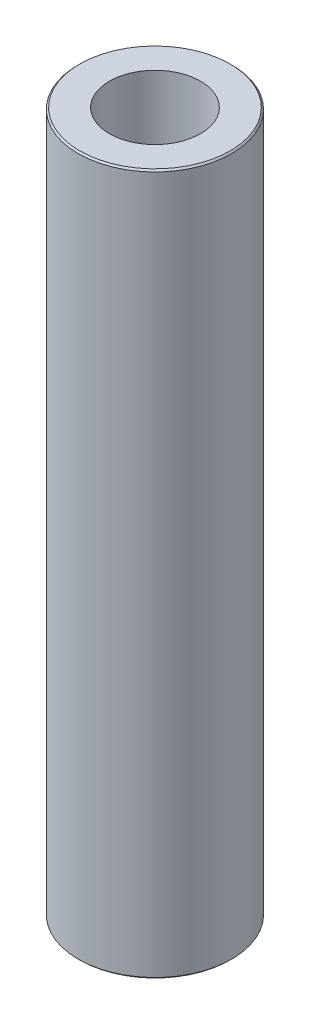
ISO-10303-21;
HEADER;
FILE_DESCRIPTION(('STEP AP214'),'2;1');
FILE_NAME('part.step','',(''),(''),'','','');
FILE_SCHEMA(('AUTOMOTIVE_DESIGN { 1 0 10303 214 1 1 1 1 }'));
ENDSEC;
DATA;
#1=APPLICATION_CONTEXT('core data for automotive mechanical design processes');
#2=APPLICATION_PROTOCOL_DEFINITION('international standard','automotive_design',2000,#1);
#3=PRODUCT_CONTEXT('',#1,'mechanical');
#4=PRODUCT('Part','Part','',(#3));
#5=PRODUCT_RELATED_PRODUCT_CATEGORY('part','',(#4));
#6=PRODUCT_DEFINITION_FORMATION('','',#4);
#7=PRODUCT_DEFINITION_CONTEXT('part definition',#1,'design');
#8=PRODUCT_DEFINITION('design','',#6,#7);
#9=PRODUCT_DEFINITION_SHAPE('','',#8);
#10=(LENGTH_UNIT() NAMED_UNIT(*) SI_UNIT(.MILLI.,.METRE.));
#11=(NAMED_UNIT(*) PLANE_ANGLE_UNIT() SI_UNIT($,.RADIAN.));
#12=(NAMED_UNIT(*) SI_UNIT($,.STERADIAN.) SOLID_ANGLE_UNIT());
#13=UNCERTAINTY_MEASURE_WITH_UNIT(LENGTH_MEASURE(1.E-05),#10,'distance_accuracy_value','');
#14=(GEOMETRIC_REPRESENTATION_CONTEXT(3) GLOBAL_UNCERTAINTY_ASSIGNED_CONTEXT((#13)) GLOBAL_UNIT_ASSIGNED_CONTEXT((#10,
#11,#12)) REPRESENTATION_CONTEXT('',''));
#15=CARTESIAN_POINT('',(0.,0.,0.));
#16=DIRECTION('',(0.,0.,1.));
#17=DIRECTION('',(1.,0.,0.));
#18=AXIS2_PLACEMENT_3D('',#15,#16,#17);
#19=CARTESIAN_POINT('',(0.,136.844788613689,0.));
#20=DIRECTION('',(0.,-1.,0.));
#21=DIRECTION('',(0.,0.,-1.));
#22=AXIS2_PLACEMENT_3D('',#19,#20,#21);
#23=CYLINDRICAL_SURFACE('',#22,15.);
#24=CARTESIAN_POINT('',(0.,136.538289550029,0.));
#25=DIRECTION('',(0.,1.,0.));
#26=DIRECTION('',(0.,0.,1.));
#27=AXIS2_PLACEMENT_3D('',#24,#25,#26);
#28=CIRCLE('',#27,15.);
#29=CARTESIAN_POINT('',(0.,136.538289550029,15.));
#30=VERTEX_POINT('',#29);
#31=EDGE_CURVE('E50',#30,#30,#28,.F.);
#32=ORIENTED_EDGE('',*,*,#31,.T.);
#33=EDGE_LOOP('',(#32));
#34=FACE_BOUND('',#33,.T.);
#35=CARTESIAN_POINT('',(0.,0.306499063659871,0.));
#36=DIRECTION('',(0.,1.,0.));
#37=DIRECTION('',(0.,0.,1.));
#38=AXIS2_PLACEMENT_3D('',#35,#36,#37);
#39=CIRCLE('',#38,15.);
#40=CARTESIAN_POINT('',(0.,0.306499063659871,15.));
#41=VERTEX_POINT('',#40);
#42=EDGE_CURVE('E51',#41,#41,#39,.T.);
#43=ORIENTED_EDGE('',*,*,#42,.T.);
#44=EDGE_LOOP('',(#43));
#45=FACE_BOUND('',#44,.T.);
#46=ADVANCED_FACE('F39',(#34,#45),#23,.T.);
#47=CARTESIAN_POINT('',(0.,136.844788613689,0.));
#48=DIRECTION('',(0.,1.,0.));
#49=DIRECTION('',(0.,0.,1.));
#50=AXIS2_PLACEMENT_3D('',#47,#48,#49);
#51=PLANE('',#50);
#52=CARTESIAN_POINT('',(0.,136.844788613689,0.));
#53=DIRECTION('',(0.,1.,0.));
#54=DIRECTION('',(0.,0.,1.));
#55=AXIS2_PLACEMENT_3D('',#52,#53,#54);
#56=CIRCLE('',#55,14.6935009363401);
#57=CARTESIAN_POINT('',(0.,136.844788613689,14.6935009363401));
#58=VERTEX_POINT('',#57);
#59=EDGE_CURVE('E54',#58,#58,#56,.T.);
#60=ORIENTED_EDGE('',*,*,#59,.T.);
#61=EDGE_LOOP('',(#60));
#62=FACE_BOUND('',#61,.T.);
#63=CARTESIAN_POINT('',(0.,136.844788613689,0.));
#64=DIRECTION('',(0.,1.,0.));
#65=DIRECTION('',(0.,0.,1.));
#66=AXIS2_PLACEMENT_3D('',#63,#64,#65);
#67=CIRCLE('',#66,8.89368777919611);
#68=CARTESIAN_POINT('',(0.,136.844788613689,8.89368777919611));
#69=VERTEX_POINT('',#68);
#70=EDGE_CURVE('E58',#69,#69,#67,.T.);
#71=ORIENTED_EDGE('',*,*,#70,.F.);
#72=EDGE_LOOP('',(#71));
#73=FACE_BOUND('',#72,.T.);
#74=ADVANCED_FACE('F69',(#62,#73),#51,.T.);
#75=CARTESIAN_POINT('',(0.,0.,0.));
#76=DIRECTION('',(0.,1.,0.));
#77=DIRECTION('',(0.,0.,1.));
#78=AXIS2_PLACEMENT_3D('',#75,#76,#77);
#79=PLANE('',#78);
#80=CARTESIAN_POINT('',(0.,0.,0.));
#81=DIRECTION('',(0.,1.,0.));
#82=DIRECTION('',(0.,0.,1.));
#83=AXIS2_PLACEMENT_3D('',#80,#81,#82);
#84=CIRCLE('',#83,14.6935009363401);
#85=CARTESIAN_POINT('',(0.,0.,14.6935009363401));
#86=VERTEX_POINT('',#85);
#87=EDGE_CURVE('E10',#86,#86,#84,.F.);
#88=ORIENTED_EDGE('',*,*,#87,.T.);
#89=EDGE_LOOP('',(#88));
#90=FACE_BOUND('',#89,.T.);
#91=CARTESIAN_POINT('',(0.,0.,0.));
#92=DIRECTION('',(0.,1.,0.));
#93=DIRECTION('',(0.,0.,1.));
#94=AXIS2_PLACEMENT_3D('',#91,#92,#93);
#95=CIRCLE('',#94,8.89368777919611);
#96=CARTESIAN_POINT('',(0.,0.,8.89368777919611));
#97=VERTEX_POINT('',#96);
#98=EDGE_CURVE('E63',#97,#97,#95,.T.);
#99=ORIENTED_EDGE('',*,*,#98,.T.);
#100=EDGE_LOOP('',(#99));
#101=FACE_BOUND('',#100,.T.);
#102=ADVANCED_FACE('F75',(#90,#101),#79,.F.);
#103=CARTESIAN_POINT('',(0.,136.844788613689,0.));
#104=DIRECTION('',(0.,-1.,0.));
#105=DIRECTION('',(0.,0.,-1.));
#106=AXIS2_PLACEMENT_3D('',#103,#104,#105);
#107=CYLINDRICAL_SURFACE('',#106,8.89368777919611);
#108=ORIENTED_EDGE('',*,*,#70,.T.);
#109=EDGE_LOOP('',(#108));
#110=FACE_BOUND('',#109,.T.);
#111=ORIENTED_EDGE('',*,*,#98,.F.);
#112=EDGE_LOOP('',(#111));
#113=FACE_BOUND('',#112,.T.);
#114=ADVANCED_FACE('F70',(#110,#113),#107,.F.);
#115=CARTESIAN_POINT('',(0.,136.844788613689,0.));
#116=DIRECTION('',(0.,-1.,0.));
#117=DIRECTION('',(0.,0.,-1.));
#118=AXIS2_PLACEMENT_3D('',#115,#116,#117);
#119=CONICAL_SURFACE('',#118,14.6935009363401,0.785398163397451);
#120=ORIENTED_EDGE('',*,*,#31,.F.);
#121=EDGE_LOOP('',(#120));
#122=FACE_BOUND('',#121,.T.);
#123=ORIENTED_EDGE('',*,*,#59,.F.);
#124=EDGE_LOOP('',(#123));
#125=FACE_BOUND('',#124,.T.);
#126=ADVANCED_FACE('F81',(#122,#125),#119,.T.);
#127=CARTESIAN_POINT('',(0.,0.306499063659871,0.));
#128=DIRECTION('',(0.,1.,0.));
#129=DIRECTION('',(0.,0.,1.));
#130=AXIS2_PLACEMENT_3D('',#127,#128,#129);
#131=CONICAL_SURFACE('',#130,15.,0.785398163397448);
#132=ORIENTED_EDGE('',*,*,#87,.F.);
#133=EDGE_LOOP('',(#132));
#134=FACE_BOUND('',#133,.T.);
#135=ORIENTED_EDGE('',*,*,#42,.F.);
#136=EDGE_LOOP('',(#135));
#137=FACE_BOUND('',#136,.T.);
#138=ADVANCED_FACE('F45',(#134,#137),#131,.T.);
#139=CLOSED_SHELL('',(#46,#74,#102,#114,#126,#138));
#140=MANIFOLD_SOLID_BREP('B2',#139);
#141=ADVANCED_BREP_SHAPE_REPRESENTATION('',(#18,#140),#14);
#142=SHAPE_DEFINITION_REPRESENTATION(#9,#141);
ENDSEC;
END-ISO-10303-21;
